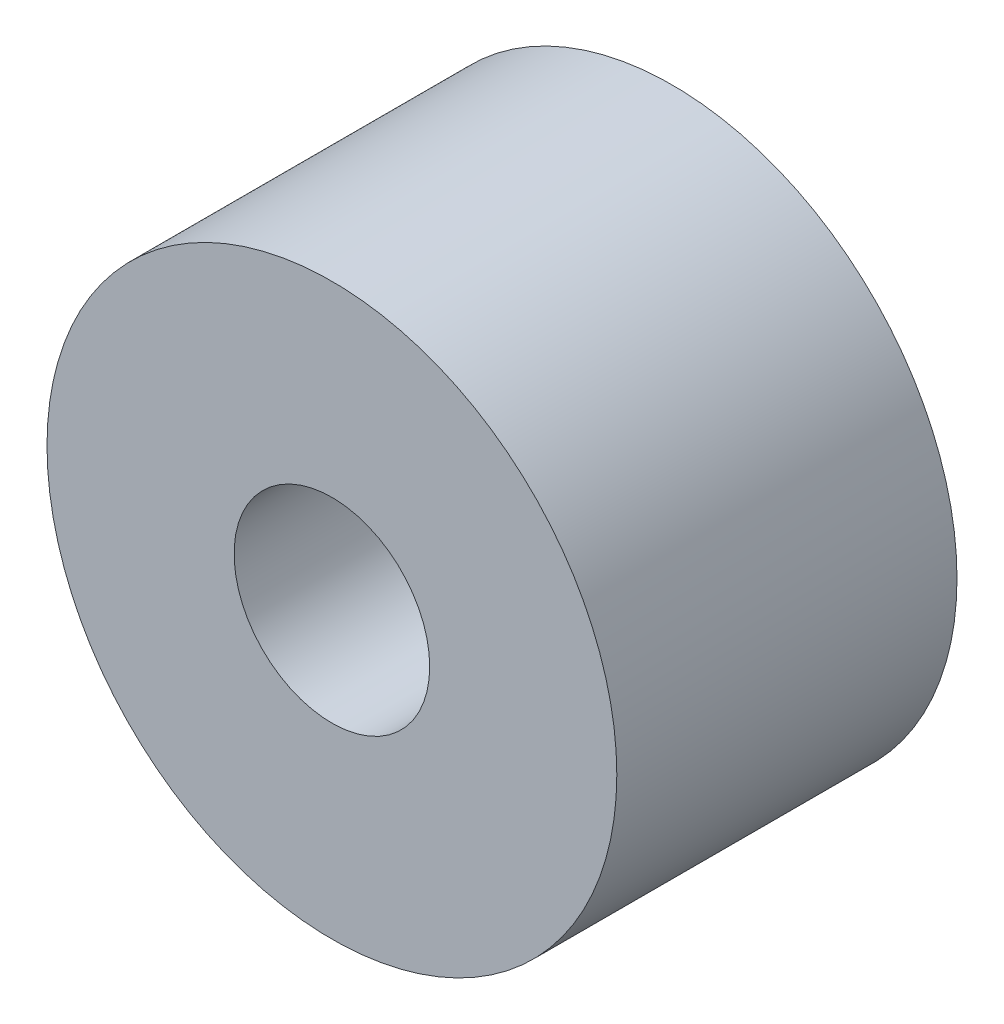
ISO-10303-21;
HEADER;
FILE_DESCRIPTION(('STEP AP214'),'2;1');
FILE_NAME('part.step','',(''),(''),'','','');
FILE_SCHEMA(('AUTOMOTIVE_DESIGN { 1 0 10303 214 1 1 1 1 }'));
ENDSEC;
DATA;
#1=APPLICATION_CONTEXT('core data for automotive mechanical design processes');
#2=APPLICATION_PROTOCOL_DEFINITION('international standard','automotive_design',2000,#1);
#3=PRODUCT_CONTEXT('',#1,'mechanical');
#4=PRODUCT('Part','Part','',(#3));
#5=PRODUCT_RELATED_PRODUCT_CATEGORY('part','',(#4));
#6=PRODUCT_DEFINITION_FORMATION('','',#4);
#7=PRODUCT_DEFINITION_CONTEXT('part definition',#1,'design');
#8=PRODUCT_DEFINITION('design','',#6,#7);
#9=PRODUCT_DEFINITION_SHAPE('','',#8);
#10=(LENGTH_UNIT() NAMED_UNIT(*) SI_UNIT(.MILLI.,.METRE.));
#11=(NAMED_UNIT(*) PLANE_ANGLE_UNIT() SI_UNIT($,.RADIAN.));
#12=(NAMED_UNIT(*) SI_UNIT($,.STERADIAN.) SOLID_ANGLE_UNIT());
#13=UNCERTAINTY_MEASURE_WITH_UNIT(LENGTH_MEASURE(1.E-05),#10,'distance_accuracy_value','');
#14=(GEOMETRIC_REPRESENTATION_CONTEXT(3) GLOBAL_UNCERTAINTY_ASSIGNED_CONTEXT((#13)) GLOBAL_UNIT_ASSIGNED_CONTEXT((#10,
#11,#12)) REPRESENTATION_CONTEXT('',''));
#15=CARTESIAN_POINT('',(0.,0.,0.));
#16=DIRECTION('',(0.,0.,1.));
#17=DIRECTION('',(1.,0.,0.));
#18=AXIS2_PLACEMENT_3D('',#15,#16,#17);
#19=CARTESIAN_POINT('',(0.,0.,5.08));
#20=DIRECTION('',(0.,0.,1.));
#21=DIRECTION('',(1.,0.,0.));
#22=AXIS2_PLACEMENT_3D('',#19,#20,#21);
#23=PLANE('',#22);
#24=CARTESIAN_POINT('',(0.,0.,5.08));
#25=DIRECTION('',(0.,0.,1.));
#26=DIRECTION('',(1.,0.,0.));
#27=AXIS2_PLACEMENT_3D('',#24,#25,#26);
#28=CIRCLE('',#27,4.2545);
#29=CARTESIAN_POINT('',(4.2545,0.,5.08));
#30=VERTEX_POINT('',#29);
#31=EDGE_CURVE('E10',#30,#30,#28,.T.);
#32=ORIENTED_EDGE('',*,*,#31,.T.);
#33=EDGE_LOOP('',(#32));
#34=FACE_BOUND('',#33,.T.);
#35=CARTESIAN_POINT('',(0.,0.,5.08));
#36=DIRECTION('',(0.,0.,1.));
#37=DIRECTION('',(1.,0.,0.));
#38=AXIS2_PLACEMENT_3D('',#35,#36,#37);
#39=CIRCLE('',#38,1.4605);
#40=CARTESIAN_POINT('',(1.4605,0.,5.08));
#41=VERTEX_POINT('',#40);
#42=EDGE_CURVE('E41',#41,#41,#39,.T.);
#43=ORIENTED_EDGE('',*,*,#42,.F.);
#44=EDGE_LOOP('',(#43));
#45=FACE_BOUND('',#44,.T.);
#46=ADVANCED_FACE('F30',(#34,#45),#23,.T.);
#47=CARTESIAN_POINT('',(0.,0.,0.));
#48=DIRECTION('',(0.,0.,1.));
#49=DIRECTION('',(1.,0.,0.));
#50=AXIS2_PLACEMENT_3D('',#47,#48,#49);
#51=PLANE('',#50);
#52=CARTESIAN_POINT('',(0.,0.,0.));
#53=DIRECTION('',(0.,0.,1.));
#54=DIRECTION('',(1.,0.,0.));
#55=AXIS2_PLACEMENT_3D('',#52,#53,#54);
#56=CIRCLE('',#55,4.2545);
#57=CARTESIAN_POINT('',(4.2545,0.,0.));
#58=VERTEX_POINT('',#57);
#59=EDGE_CURVE('E34',#58,#58,#56,.T.);
#60=ORIENTED_EDGE('',*,*,#59,.F.);
#61=EDGE_LOOP('',(#60));
#62=FACE_BOUND('',#61,.T.);
#63=CARTESIAN_POINT('',(0.,0.,0.));
#64=DIRECTION('',(0.,0.,1.));
#65=DIRECTION('',(1.,0.,0.));
#66=AXIS2_PLACEMENT_3D('',#63,#64,#65);
#67=CIRCLE('',#66,1.4605);
#68=CARTESIAN_POINT('',(1.4605,0.,0.));
#69=VERTEX_POINT('',#68);
#70=EDGE_CURVE('E43',#69,#69,#67,.T.);
#71=ORIENTED_EDGE('',*,*,#70,.T.);
#72=EDGE_LOOP('',(#71));
#73=FACE_BOUND('',#72,.T.);
#74=ADVANCED_FACE('F53',(#62,#73),#51,.F.);
#75=CARTESIAN_POINT('',(0.,0.,5.08));
#76=DIRECTION('',(0.,0.,-1.));
#77=DIRECTION('',(-1.,0.,0.));
#78=AXIS2_PLACEMENT_3D('',#75,#76,#77);
#79=CYLINDRICAL_SURFACE('',#78,4.2545);
#80=ORIENTED_EDGE('',*,*,#31,.F.);
#81=EDGE_LOOP('',(#80));
#82=FACE_BOUND('',#81,.T.);
#83=ORIENTED_EDGE('',*,*,#59,.T.);
#84=EDGE_LOOP('',(#83));
#85=FACE_BOUND('',#84,.T.);
#86=ADVANCED_FACE('F32',(#82,#85),#79,.T.);
#87=CARTESIAN_POINT('',(0.,0.,5.08));
#88=DIRECTION('',(0.,0.,-1.));
#89=DIRECTION('',(-1.,0.,0.));
#90=AXIS2_PLACEMENT_3D('',#87,#88,#89);
#91=CYLINDRICAL_SURFACE('',#90,1.4605);
#92=ORIENTED_EDGE('',*,*,#42,.T.);
#93=EDGE_LOOP('',(#92));
#94=FACE_BOUND('',#93,.T.);
#95=ORIENTED_EDGE('',*,*,#70,.F.);
#96=EDGE_LOOP('',(#95));
#97=FACE_BOUND('',#96,.T.);
#98=ADVANCED_FACE('F49',(#94,#97),#91,.F.);
#99=CLOSED_SHELL('',(#46,#74,#86,#98));
#100=MANIFOLD_SOLID_BREP('B2',#99);
#101=ADVANCED_BREP_SHAPE_REPRESENTATION('',(#18,#100),#14);
#102=SHAPE_DEFINITION_REPRESENTATION(#9,#101);
ENDSEC;
END-ISO-10303-21;
